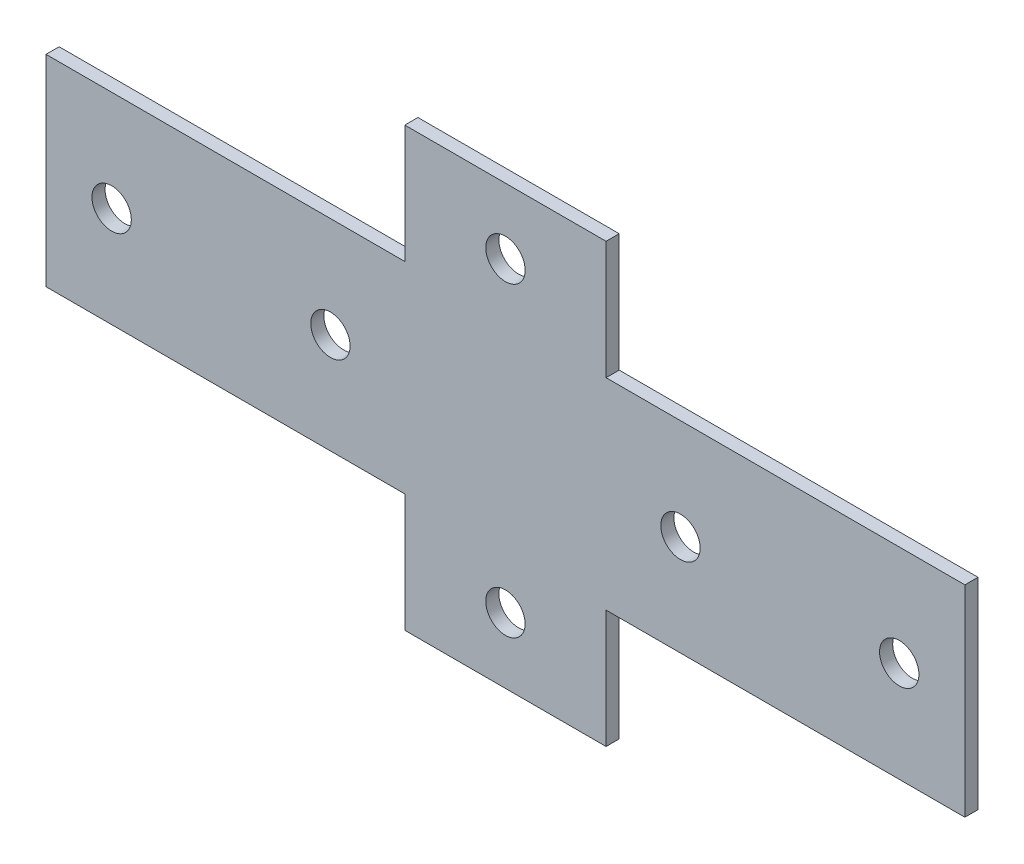
ISO-10303-21;
HEADER;
FILE_DESCRIPTION(('STEP AP214'),'2;1');
FILE_NAME('part.step','',(''),(''),'','','');
FILE_SCHEMA(('AUTOMOTIVE_DESIGN { 1 0 10303 214 1 1 1 1 }'));
ENDSEC;
DATA;
#1=APPLICATION_CONTEXT('core data for automotive mechanical design processes');
#2=APPLICATION_PROTOCOL_DEFINITION('international standard','automotive_design',2000,#1);
#3=PRODUCT_CONTEXT('',#1,'mechanical');
#4=PRODUCT('Part','Part','',(#3));
#5=PRODUCT_RELATED_PRODUCT_CATEGORY('part','',(#4));
#6=PRODUCT_DEFINITION_FORMATION('','',#4);
#7=PRODUCT_DEFINITION_CONTEXT('part definition',#1,'design');
#8=PRODUCT_DEFINITION('design','',#6,#7);
#9=PRODUCT_DEFINITION_SHAPE('','',#8);
#10=(LENGTH_UNIT() NAMED_UNIT(*) SI_UNIT(.MILLI.,.METRE.));
#11=(NAMED_UNIT(*) PLANE_ANGLE_UNIT() SI_UNIT($,.RADIAN.));
#12=(NAMED_UNIT(*) SI_UNIT($,.STERADIAN.) SOLID_ANGLE_UNIT());
#13=UNCERTAINTY_MEASURE_WITH_UNIT(LENGTH_MEASURE(1.E-05),#10,'distance_accuracy_value','');
#14=(GEOMETRIC_REPRESENTATION_CONTEXT(3) GLOBAL_UNCERTAINTY_ASSIGNED_CONTEXT((#13)) GLOBAL_UNIT_ASSIGNED_CONTEXT((#10,
#11,#12)) REPRESENTATION_CONTEXT('',''));
#15=CARTESIAN_POINT('',(0.,0.,0.));
#16=DIRECTION('',(0.,0.,1.));
#17=DIRECTION('',(1.,0.,0.));
#18=AXIS2_PLACEMENT_3D('',#15,#16,#17);
#19=CARTESIAN_POINT('',(0.,0.,3.));
#20=DIRECTION('',(0.,0.,1.));
#21=DIRECTION('',(1.,0.,0.));
#22=AXIS2_PLACEMENT_3D('',#19,#20,#21);
#23=PLANE('',#22);
#24=CARTESIAN_POINT('',(39.9999999999999,0.,3.));
#25=DIRECTION('',(0.,0.,1.));
#26=DIRECTION('',(-1.,0.,0.));
#27=AXIS2_PLACEMENT_3D('',#24,#25,#26);
#28=CIRCLE('',#27,4.5);
#29=CARTESIAN_POINT('',(35.4999999999999,0.,3.));
#30=VERTEX_POINT('',#29);
#31=EDGE_CURVE('E300',#30,#30,#28,.T.);
#32=ORIENTED_EDGE('',*,*,#31,.F.);
#33=EDGE_LOOP('',(#32));
#34=FACE_BOUND('',#33,.T.);
#35=CARTESIAN_POINT('',(-89.9999999999999,0.,3.));
#36=DIRECTION('',(0.,0.,1.));
#37=DIRECTION('',(1.,0.,0.));
#38=AXIS2_PLACEMENT_3D('',#35,#36,#37);
#39=CIRCLE('',#38,4.5);
#40=CARTESIAN_POINT('',(-85.4999999999999,0.,3.));
#41=VERTEX_POINT('',#40);
#42=EDGE_CURVE('E312',#41,#41,#39,.T.);
#43=ORIENTED_EDGE('',*,*,#42,.F.);
#44=EDGE_LOOP('',(#43));
#45=FACE_BOUND('',#44,.T.);
#46=CARTESIAN_POINT('',(0.,-35.,3.));
#47=DIRECTION('',(0.,0.,1.));
#48=DIRECTION('',(1.,0.,0.));
#49=AXIS2_PLACEMENT_3D('',#46,#47,#48);
#50=CIRCLE('',#49,4.5);
#51=CARTESIAN_POINT('',(4.5,-35.,3.));
#52=VERTEX_POINT('',#51);
#53=EDGE_CURVE('E159',#52,#52,#50,.T.);
#54=ORIENTED_EDGE('',*,*,#53,.F.);
#55=EDGE_LOOP('',(#54));
#56=FACE_BOUND('',#55,.T.);
#57=DIRECTION('',(0.,1.,0.));
#58=VECTOR('',#57,1.);
#59=CARTESIAN_POINT('',(105.,23.,3.));
#60=LINE('',#59,#58);
#61=CARTESIAN_POINT('',(105.,-23.,3.));
#62=VERTEX_POINT('',#61);
#63=CARTESIAN_POINT('',(105.,23.,3.));
#64=VERTEX_POINT('',#63);
#65=EDGE_CURVE('E178',#62,#64,#60,.T.);
#66=ORIENTED_EDGE('',*,*,#65,.T.);
#67=DIRECTION('',(-1.,0.,0.));
#68=VECTOR('',#67,1.);
#69=CARTESIAN_POINT('',(23.,23.,3.));
#70=LINE('',#69,#68);
#71=CARTESIAN_POINT('',(23.,23.,3.));
#72=VERTEX_POINT('',#71);
#73=EDGE_CURVE('E106',#64,#72,#70,.T.);
#74=ORIENTED_EDGE('',*,*,#73,.T.);
#75=DIRECTION('',(0.,1.,0.));
#76=VECTOR('',#75,1.);
#77=CARTESIAN_POINT('',(23.,23.,3.));
#78=LINE('',#77,#76);
#79=CARTESIAN_POINT('',(23.,50.,3.));
#80=VERTEX_POINT('',#79);
#81=EDGE_CURVE('E205',#72,#80,#78,.T.);
#82=ORIENTED_EDGE('',*,*,#81,.T.);
#83=DIRECTION('',(-1.,0.,0.));
#84=VECTOR('',#83,1.);
#85=CARTESIAN_POINT('',(-23.,50.,3.));
#86=LINE('',#85,#84);
#87=CARTESIAN_POINT('',(-23.,50.,3.));
#88=VERTEX_POINT('',#87);
#89=EDGE_CURVE('E224',#80,#88,#86,.T.);
#90=ORIENTED_EDGE('',*,*,#89,.T.);
#91=DIRECTION('',(0.,-1.,0.));
#92=VECTOR('',#91,1.);
#93=CARTESIAN_POINT('',(-23.,23.,3.));
#94=LINE('',#93,#92);
#95=CARTESIAN_POINT('',(-23.,23.,3.));
#96=VERTEX_POINT('',#95);
#97=EDGE_CURVE('E221',#88,#96,#94,.T.);
#98=ORIENTED_EDGE('',*,*,#97,.T.);
#99=DIRECTION('',(-1.,0.,0.));
#100=VECTOR('',#99,1.);
#101=CARTESIAN_POINT('',(-105.,23.,3.));
#102=LINE('',#101,#100);
#103=CARTESIAN_POINT('',(-105.,23.,3.));
#104=VERTEX_POINT('',#103);
#105=EDGE_CURVE('E223',#96,#104,#102,.T.);
#106=ORIENTED_EDGE('',*,*,#105,.T.);
#107=DIRECTION('',(0.,-1.,0.));
#108=VECTOR('',#107,1.);
#109=CARTESIAN_POINT('',(-105.,23.,3.));
#110=LINE('',#109,#108);
#111=CARTESIAN_POINT('',(-105.,-23.,3.));
#112=VERTEX_POINT('',#111);
#113=EDGE_CURVE('E226',#104,#112,#110,.T.);
#114=ORIENTED_EDGE('',*,*,#113,.T.);
#115=DIRECTION('',(1.,0.,0.));
#116=VECTOR('',#115,1.);
#117=CARTESIAN_POINT('',(-105.,-23.,3.));
#118=LINE('',#117,#116);
#119=CARTESIAN_POINT('',(-23.,-23.,3.));
#120=VERTEX_POINT('',#119);
#121=EDGE_CURVE('E232',#112,#120,#118,.T.);
#122=ORIENTED_EDGE('',*,*,#121,.T.);
#123=DIRECTION('',(0.,-1.,0.));
#124=VECTOR('',#123,1.);
#125=CARTESIAN_POINT('',(-23.,-50.,3.));
#126=LINE('',#125,#124);
#127=CARTESIAN_POINT('',(-23.,-50.,3.));
#128=VERTEX_POINT('',#127);
#129=EDGE_CURVE('E137',#120,#128,#126,.T.);
#130=ORIENTED_EDGE('',*,*,#129,.T.);
#131=DIRECTION('',(1.,0.,0.));
#132=VECTOR('',#131,1.);
#133=CARTESIAN_POINT('',(-23.,-50.,3.));
#134=LINE('',#133,#132);
#135=CARTESIAN_POINT('',(23.,-50.,3.));
#136=VERTEX_POINT('',#135);
#137=EDGE_CURVE('E131',#128,#136,#134,.T.);
#138=ORIENTED_EDGE('',*,*,#137,.T.);
#139=DIRECTION('',(0.,1.,0.));
#140=VECTOR('',#139,1.);
#141=CARTESIAN_POINT('',(23.,-50.,3.));
#142=LINE('',#141,#140);
#143=CARTESIAN_POINT('',(23.,-23.,3.));
#144=VERTEX_POINT('',#143);
#145=EDGE_CURVE('E135',#136,#144,#142,.T.);
#146=ORIENTED_EDGE('',*,*,#145,.T.);
#147=DIRECTION('',(1.,0.,0.));
#148=VECTOR('',#147,1.);
#149=CARTESIAN_POINT('',(23.,-23.,3.));
#150=LINE('',#149,#148);
#151=EDGE_CURVE('E51',#144,#62,#150,.T.);
#152=ORIENTED_EDGE('',*,*,#151,.T.);
#153=EDGE_LOOP('',(#66,#74,#82,#90,#98,#106,#114,#122,#130,#138,#146,#152));
#154=FACE_BOUND('',#153,.T.);
#155=CARTESIAN_POINT('',(0.,35.,3.));
#156=DIRECTION('',(0.,0.,1.));
#157=DIRECTION('',(1.,0.,0.));
#158=AXIS2_PLACEMENT_3D('',#155,#156,#157);
#159=CIRCLE('',#158,4.5);
#160=CARTESIAN_POINT('',(4.5,35.,3.));
#161=VERTEX_POINT('',#160);
#162=EDGE_CURVE('E318',#161,#161,#159,.T.);
#163=ORIENTED_EDGE('',*,*,#162,.F.);
#164=EDGE_LOOP('',(#163));
#165=FACE_BOUND('',#164,.T.);
#166=CARTESIAN_POINT('',(-39.9999999999999,0.,3.));
#167=DIRECTION('',(0.,0.,1.));
#168=DIRECTION('',(1.,0.,0.));
#169=AXIS2_PLACEMENT_3D('',#166,#167,#168);
#170=CIRCLE('',#169,4.5);
#171=CARTESIAN_POINT('',(-35.4999999999999,0.,3.));
#172=VERTEX_POINT('',#171);
#173=EDGE_CURVE('E306',#172,#172,#170,.T.);
#174=ORIENTED_EDGE('',*,*,#173,.F.);
#175=EDGE_LOOP('',(#174));
#176=FACE_BOUND('',#175,.T.);
#177=CARTESIAN_POINT('',(89.9999999999999,0.,3.));
#178=DIRECTION('',(0.,0.,1.));
#179=DIRECTION('',(-1.,0.,0.));
#180=AXIS2_PLACEMENT_3D('',#177,#178,#179);
#181=CIRCLE('',#180,4.5);
#182=CARTESIAN_POINT('',(85.4999999999999,0.,3.));
#183=VERTEX_POINT('',#182);
#184=EDGE_CURVE('E291',#183,#183,#181,.T.);
#185=ORIENTED_EDGE('',*,*,#184,.F.);
#186=EDGE_LOOP('',(#185));
#187=FACE_BOUND('',#186,.T.);
#188=ADVANCED_FACE('F34',(#34,#45,#56,#154,#165,#176,#187),#23,.T.);
#189=CARTESIAN_POINT('',(0.,0.,0.));
#190=DIRECTION('',(0.,0.,1.));
#191=DIRECTION('',(1.,0.,0.));
#192=AXIS2_PLACEMENT_3D('',#189,#190,#191);
#193=PLANE('',#192);
#194=DIRECTION('',(0.,1.,0.));
#195=VECTOR('',#194,1.);
#196=CARTESIAN_POINT('',(105.,23.,0.));
#197=LINE('',#196,#195);
#198=CARTESIAN_POINT('',(105.,-23.,0.));
#199=VERTEX_POINT('',#198);
#200=CARTESIAN_POINT('',(105.,23.,0.));
#201=VERTEX_POINT('',#200);
#202=EDGE_CURVE('E155',#199,#201,#197,.T.);
#203=ORIENTED_EDGE('',*,*,#202,.F.);
#204=DIRECTION('',(1.,0.,0.));
#205=VECTOR('',#204,1.);
#206=CARTESIAN_POINT('',(23.,-23.,0.));
#207=LINE('',#206,#205);
#208=CARTESIAN_POINT('',(23.,-23.,0.));
#209=VERTEX_POINT('',#208);
#210=EDGE_CURVE('E98',#209,#199,#207,.T.);
#211=ORIENTED_EDGE('',*,*,#210,.F.);
#212=DIRECTION('',(0.,1.,0.));
#213=VECTOR('',#212,1.);
#214=CARTESIAN_POINT('',(23.,-50.,0.));
#215=LINE('',#214,#213);
#216=CARTESIAN_POINT('',(23.,-50.,0.));
#217=VERTEX_POINT('',#216);
#218=EDGE_CURVE('E92',#217,#209,#215,.T.);
#219=ORIENTED_EDGE('',*,*,#218,.F.);
#220=DIRECTION('',(1.,0.,0.));
#221=VECTOR('',#220,1.);
#222=CARTESIAN_POINT('',(-23.,-50.,0.));
#223=LINE('',#222,#221);
#224=CARTESIAN_POINT('',(-23.,-50.,0.));
#225=VERTEX_POINT('',#224);
#226=EDGE_CURVE('E145',#225,#217,#223,.T.);
#227=ORIENTED_EDGE('',*,*,#226,.F.);
#228=DIRECTION('',(0.,-1.,0.));
#229=VECTOR('',#228,1.);
#230=CARTESIAN_POINT('',(-23.,-50.,0.));
#231=LINE('',#230,#229);
#232=CARTESIAN_POINT('',(-23.,-23.,0.));
#233=VERTEX_POINT('',#232);
#234=EDGE_CURVE('E173',#233,#225,#231,.T.);
#235=ORIENTED_EDGE('',*,*,#234,.F.);
#236=DIRECTION('',(1.,0.,0.));
#237=VECTOR('',#236,1.);
#238=CARTESIAN_POINT('',(-105.,-23.,0.));
#239=LINE('',#238,#237);
#240=CARTESIAN_POINT('',(-105.,-23.,0.));
#241=VERTEX_POINT('',#240);
#242=EDGE_CURVE('E171',#241,#233,#239,.T.);
#243=ORIENTED_EDGE('',*,*,#242,.F.);
#244=DIRECTION('',(0.,-1.,0.));
#245=VECTOR('',#244,1.);
#246=CARTESIAN_POINT('',(-105.,23.,0.));
#247=LINE('',#246,#245);
#248=CARTESIAN_POINT('',(-105.,23.,0.));
#249=VERTEX_POINT('',#248);
#250=EDGE_CURVE('E169',#249,#241,#247,.T.);
#251=ORIENTED_EDGE('',*,*,#250,.F.);
#252=DIRECTION('',(-1.,0.,0.));
#253=VECTOR('',#252,1.);
#254=CARTESIAN_POINT('',(-105.,23.,0.));
#255=LINE('',#254,#253);
#256=CARTESIAN_POINT('',(-23.,23.,0.));
#257=VERTEX_POINT('',#256);
#258=EDGE_CURVE('E167',#257,#249,#255,.T.);
#259=ORIENTED_EDGE('',*,*,#258,.F.);
#260=DIRECTION('',(0.,-1.,0.));
#261=VECTOR('',#260,1.);
#262=CARTESIAN_POINT('',(-23.,23.,0.));
#263=LINE('',#262,#261);
#264=CARTESIAN_POINT('',(-23.,50.,0.));
#265=VERTEX_POINT('',#264);
#266=EDGE_CURVE('E165',#265,#257,#263,.T.);
#267=ORIENTED_EDGE('',*,*,#266,.F.);
#268=DIRECTION('',(-1.,0.,0.));
#269=VECTOR('',#268,1.);
#270=CARTESIAN_POINT('',(-23.,50.,0.));
#271=LINE('',#270,#269);
#272=CARTESIAN_POINT('',(23.,50.,0.));
#273=VERTEX_POINT('',#272);
#274=EDGE_CURVE('E163',#273,#265,#271,.T.);
#275=ORIENTED_EDGE('',*,*,#274,.F.);
#276=DIRECTION('',(0.,1.,0.));
#277=VECTOR('',#276,1.);
#278=CARTESIAN_POINT('',(23.,23.,0.));
#279=LINE('',#278,#277);
#280=CARTESIAN_POINT('',(23.,23.,0.));
#281=VERTEX_POINT('',#280);
#282=EDGE_CURVE('E161',#281,#273,#279,.T.);
#283=ORIENTED_EDGE('',*,*,#282,.F.);
#284=DIRECTION('',(-1.,0.,0.));
#285=VECTOR('',#284,1.);
#286=CARTESIAN_POINT('',(23.,23.,0.));
#287=LINE('',#286,#285);
#288=EDGE_CURVE('E158',#201,#281,#287,.T.);
#289=ORIENTED_EDGE('',*,*,#288,.F.);
#290=EDGE_LOOP('',(#203,#211,#219,#227,#235,#243,#251,#259,#267,#275,#283,#289));
#291=FACE_BOUND('',#290,.T.);
#292=CARTESIAN_POINT('',(0.,-35.,0.));
#293=DIRECTION('',(0.,0.,1.));
#294=DIRECTION('',(1.,0.,0.));
#295=AXIS2_PLACEMENT_3D('',#292,#293,#294);
#296=CIRCLE('',#295,4.5);
#297=CARTESIAN_POINT('',(4.5,-35.,0.));
#298=VERTEX_POINT('',#297);
#299=EDGE_CURVE('E321',#298,#298,#296,.T.);
#300=ORIENTED_EDGE('',*,*,#299,.T.);
#301=EDGE_LOOP('',(#300));
#302=FACE_BOUND('',#301,.T.);
#303=CARTESIAN_POINT('',(0.,35.,0.));
#304=DIRECTION('',(0.,0.,1.));
#305=DIRECTION('',(1.,0.,0.));
#306=AXIS2_PLACEMENT_3D('',#303,#304,#305);
#307=CIRCLE('',#306,4.5);
#308=CARTESIAN_POINT('',(4.5,35.,0.));
#309=VERTEX_POINT('',#308);
#310=EDGE_CURVE('E315',#309,#309,#307,.T.);
#311=ORIENTED_EDGE('',*,*,#310,.T.);
#312=EDGE_LOOP('',(#311));
#313=FACE_BOUND('',#312,.T.);
#314=CARTESIAN_POINT('',(-89.9999999999999,0.,0.));
#315=DIRECTION('',(0.,0.,1.));
#316=DIRECTION('',(1.,0.,0.));
#317=AXIS2_PLACEMENT_3D('',#314,#315,#316);
#318=CIRCLE('',#317,4.5);
#319=CARTESIAN_POINT('',(-85.4999999999999,0.,0.));
#320=VERTEX_POINT('',#319);
#321=EDGE_CURVE('E309',#320,#320,#318,.T.);
#322=ORIENTED_EDGE('',*,*,#321,.T.);
#323=EDGE_LOOP('',(#322));
#324=FACE_BOUND('',#323,.T.);
#325=CARTESIAN_POINT('',(-39.9999999999999,0.,0.));
#326=DIRECTION('',(0.,0.,1.));
#327=DIRECTION('',(1.,0.,0.));
#328=AXIS2_PLACEMENT_3D('',#325,#326,#327);
#329=CIRCLE('',#328,4.5);
#330=CARTESIAN_POINT('',(-35.4999999999999,0.,0.));
#331=VERTEX_POINT('',#330);
#332=EDGE_CURVE('E303',#331,#331,#329,.T.);
#333=ORIENTED_EDGE('',*,*,#332,.T.);
#334=EDGE_LOOP('',(#333));
#335=FACE_BOUND('',#334,.T.);
#336=CARTESIAN_POINT('',(39.9999999999999,0.,0.));
#337=DIRECTION('',(0.,0.,1.));
#338=DIRECTION('',(-1.,0.,0.));
#339=AXIS2_PLACEMENT_3D('',#336,#337,#338);
#340=CIRCLE('',#339,4.5);
#341=CARTESIAN_POINT('',(35.4999999999999,0.,0.));
#342=VERTEX_POINT('',#341);
#343=EDGE_CURVE('E297',#342,#342,#340,.T.);
#344=ORIENTED_EDGE('',*,*,#343,.T.);
#345=EDGE_LOOP('',(#344));
#346=FACE_BOUND('',#345,.T.);
#347=CARTESIAN_POINT('',(89.9999999999999,0.,0.));
#348=DIRECTION('',(0.,0.,1.));
#349=DIRECTION('',(-1.,0.,0.));
#350=AXIS2_PLACEMENT_3D('',#347,#348,#349);
#351=CIRCLE('',#350,4.5);
#352=CARTESIAN_POINT('',(85.4999999999999,0.,0.));
#353=VERTEX_POINT('',#352);
#354=EDGE_CURVE('E294',#353,#353,#351,.T.);
#355=ORIENTED_EDGE('',*,*,#354,.T.);
#356=EDGE_LOOP('',(#355));
#357=FACE_BOUND('',#356,.T.);
#358=ADVANCED_FACE('F209',(#291,#302,#313,#324,#335,#346,#357),#193,.F.);
#359=CARTESIAN_POINT('',(105.,23.,3.));
#360=DIRECTION('',(-1.,0.,0.));
#361=DIRECTION('',(0.,0.,1.));
#362=AXIS2_PLACEMENT_3D('',#359,#360,#361);
#363=PLANE('',#362);
#364=ORIENTED_EDGE('',*,*,#202,.T.);
#365=DIRECTION('',(0.,0.,-1.));
#366=VECTOR('',#365,1.);
#367=CARTESIAN_POINT('',(105.,23.,3.));
#368=LINE('',#367,#366);
#369=EDGE_CURVE('E11',#64,#201,#368,.T.);
#370=ORIENTED_EDGE('',*,*,#369,.F.);
#371=ORIENTED_EDGE('',*,*,#65,.F.);
#372=DIRECTION('',(0.,0.,-1.));
#373=VECTOR('',#372,1.);
#374=CARTESIAN_POINT('',(105.,-23.,3.));
#375=LINE('',#374,#373);
#376=EDGE_CURVE('E151',#62,#199,#375,.T.);
#377=ORIENTED_EDGE('',*,*,#376,.T.);
#378=EDGE_LOOP('',(#364,#370,#371,#377));
#379=FACE_BOUND('',#378,.T.);
#380=ADVANCED_FACE('F36',(#379),#363,.F.);
#381=CARTESIAN_POINT('',(23.,23.,3.));
#382=DIRECTION('',(0.,-1.,0.));
#383=DIRECTION('',(1.,0.,0.));
#384=AXIS2_PLACEMENT_3D('',#381,#382,#383);
#385=PLANE('',#384);
#386=ORIENTED_EDGE('',*,*,#288,.T.);
#387=DIRECTION('',(0.,0.,-1.));
#388=VECTOR('',#387,1.);
#389=CARTESIAN_POINT('',(23.,23.,3.));
#390=LINE('',#389,#388);
#391=EDGE_CURVE('E43',#72,#281,#390,.T.);
#392=ORIENTED_EDGE('',*,*,#391,.F.);
#393=ORIENTED_EDGE('',*,*,#73,.F.);
#394=ORIENTED_EDGE('',*,*,#369,.T.);
#395=EDGE_LOOP('',(#386,#392,#393,#394));
#396=FACE_BOUND('',#395,.T.);
#397=ADVANCED_FACE('F449',(#396),#385,.F.);
#398=CARTESIAN_POINT('',(23.,23.,3.));
#399=DIRECTION('',(-1.,0.,0.));
#400=DIRECTION('',(0.,0.,1.));
#401=AXIS2_PLACEMENT_3D('',#398,#399,#400);
#402=PLANE('',#401);
#403=ORIENTED_EDGE('',*,*,#282,.T.);
#404=DIRECTION('',(0.,0.,-1.));
#405=VECTOR('',#404,1.);
#406=CARTESIAN_POINT('',(23.,50.,3.));
#407=LINE('',#406,#405);
#408=EDGE_CURVE('E197',#80,#273,#407,.T.);
#409=ORIENTED_EDGE('',*,*,#408,.F.);
#410=ORIENTED_EDGE('',*,*,#81,.F.);
#411=ORIENTED_EDGE('',*,*,#391,.T.);
#412=EDGE_LOOP('',(#403,#409,#410,#411));
#413=FACE_BOUND('',#412,.T.);
#414=ADVANCED_FACE('F203',(#413),#402,.F.);
#415=CARTESIAN_POINT('',(-23.,50.,3.));
#416=DIRECTION('',(0.,-1.,0.));
#417=DIRECTION('',(0.,0.,-1.));
#418=AXIS2_PLACEMENT_3D('',#415,#416,#417);
#419=PLANE('',#418);
#420=ORIENTED_EDGE('',*,*,#274,.T.);
#421=DIRECTION('',(0.,0.,-1.));
#422=VECTOR('',#421,1.);
#423=CARTESIAN_POINT('',(-23.,50.,3.));
#424=LINE('',#423,#422);
#425=EDGE_CURVE('E194',#88,#265,#424,.T.);
#426=ORIENTED_EDGE('',*,*,#425,.F.);
#427=ORIENTED_EDGE('',*,*,#89,.F.);
#428=ORIENTED_EDGE('',*,*,#408,.T.);
#429=EDGE_LOOP('',(#420,#426,#427,#428));
#430=FACE_BOUND('',#429,.T.);
#431=ADVANCED_FACE('F215',(#430),#419,.F.);
#432=CARTESIAN_POINT('',(-23.,23.,3.));
#433=DIRECTION('',(1.,0.,0.));
#434=DIRECTION('',(0.,0.,-1.));
#435=AXIS2_PLACEMENT_3D('',#432,#433,#434);
#436=PLANE('',#435);
#437=ORIENTED_EDGE('',*,*,#266,.T.);
#438=DIRECTION('',(0.,0.,-1.));
#439=VECTOR('',#438,1.);
#440=CARTESIAN_POINT('',(-23.,23.,3.));
#441=LINE('',#440,#439);
#442=EDGE_CURVE('E191',#96,#257,#441,.T.);
#443=ORIENTED_EDGE('',*,*,#442,.F.);
#444=ORIENTED_EDGE('',*,*,#97,.F.);
#445=ORIENTED_EDGE('',*,*,#425,.T.);
#446=EDGE_LOOP('',(#437,#443,#444,#445));
#447=FACE_BOUND('',#446,.T.);
#448=ADVANCED_FACE('F219',(#447),#436,.F.);
#449=CARTESIAN_POINT('',(-105.,23.,3.));
#450=DIRECTION('',(0.,-1.,0.));
#451=DIRECTION('',(1.,0.,0.));
#452=AXIS2_PLACEMENT_3D('',#449,#450,#451);
#453=PLANE('',#452);
#454=ORIENTED_EDGE('',*,*,#258,.T.);
#455=DIRECTION('',(0.,0.,-1.));
#456=VECTOR('',#455,1.);
#457=CARTESIAN_POINT('',(-105.,23.,3.));
#458=LINE('',#457,#456);
#459=EDGE_CURVE('E188',#104,#249,#458,.T.);
#460=ORIENTED_EDGE('',*,*,#459,.F.);
#461=ORIENTED_EDGE('',*,*,#105,.F.);
#462=ORIENTED_EDGE('',*,*,#442,.T.);
#463=EDGE_LOOP('',(#454,#460,#461,#462));
#464=FACE_BOUND('',#463,.T.);
#465=ADVANCED_FACE('F414',(#464),#453,.F.);
#466=CARTESIAN_POINT('',(-105.,23.,3.));
#467=DIRECTION('',(1.,0.,0.));
#468=DIRECTION('',(0.,0.,-1.));
#469=AXIS2_PLACEMENT_3D('',#466,#467,#468);
#470=PLANE('',#469);
#471=ORIENTED_EDGE('',*,*,#250,.T.);
#472=DIRECTION('',(0.,0.,-1.));
#473=VECTOR('',#472,1.);
#474=CARTESIAN_POINT('',(-105.,-23.,3.));
#475=LINE('',#474,#473);
#476=EDGE_CURVE('E185',#112,#241,#475,.T.);
#477=ORIENTED_EDGE('',*,*,#476,.F.);
#478=ORIENTED_EDGE('',*,*,#113,.F.);
#479=ORIENTED_EDGE('',*,*,#459,.T.);
#480=EDGE_LOOP('',(#471,#477,#478,#479));
#481=FACE_BOUND('',#480,.T.);
#482=ADVANCED_FACE('F405',(#481),#470,.F.);
#483=CARTESIAN_POINT('',(-105.,-23.,3.));
#484=DIRECTION('',(0.,1.,0.));
#485=DIRECTION('',(0.,0.,1.));
#486=AXIS2_PLACEMENT_3D('',#483,#484,#485);
#487=PLANE('',#486);
#488=ORIENTED_EDGE('',*,*,#242,.T.);
#489=DIRECTION('',(0.,0.,-1.));
#490=VECTOR('',#489,1.);
#491=CARTESIAN_POINT('',(-23.,-23.,3.));
#492=LINE('',#491,#490);
#493=EDGE_CURVE('E182',#120,#233,#492,.T.);
#494=ORIENTED_EDGE('',*,*,#493,.F.);
#495=ORIENTED_EDGE('',*,*,#121,.F.);
#496=ORIENTED_EDGE('',*,*,#476,.T.);
#497=EDGE_LOOP('',(#488,#494,#495,#496));
#498=FACE_BOUND('',#497,.T.);
#499=ADVANCED_FACE('F238',(#498),#487,.F.);
#500=CARTESIAN_POINT('',(-23.,-50.,3.));
#501=DIRECTION('',(1.,0.,0.));
#502=DIRECTION('',(0.,1.,0.));
#503=AXIS2_PLACEMENT_3D('',#500,#501,#502);
#504=PLANE('',#503);
#505=ORIENTED_EDGE('',*,*,#234,.T.);
#506=DIRECTION('',(0.,0.,-1.));
#507=VECTOR('',#506,1.);
#508=CARTESIAN_POINT('',(-23.,-50.,3.));
#509=LINE('',#508,#507);
#510=EDGE_CURVE('E146',#128,#225,#509,.T.);
#511=ORIENTED_EDGE('',*,*,#510,.F.);
#512=ORIENTED_EDGE('',*,*,#129,.F.);
#513=ORIENTED_EDGE('',*,*,#493,.T.);
#514=EDGE_LOOP('',(#505,#511,#512,#513));
#515=FACE_BOUND('',#514,.T.);
#516=ADVANCED_FACE('F242',(#515),#504,.F.);
#517=CARTESIAN_POINT('',(-23.,-50.,3.));
#518=DIRECTION('',(0.,1.,0.));
#519=DIRECTION('',(0.,0.,1.));
#520=AXIS2_PLACEMENT_3D('',#517,#518,#519);
#521=PLANE('',#520);
#522=ORIENTED_EDGE('',*,*,#226,.T.);
#523=DIRECTION('',(0.,0.,-1.));
#524=VECTOR('',#523,1.);
#525=CARTESIAN_POINT('',(23.,-50.,3.));
#526=LINE('',#525,#524);
#527=EDGE_CURVE('E142',#136,#217,#526,.T.);
#528=ORIENTED_EDGE('',*,*,#527,.F.);
#529=ORIENTED_EDGE('',*,*,#137,.F.);
#530=ORIENTED_EDGE('',*,*,#510,.T.);
#531=EDGE_LOOP('',(#522,#528,#529,#530));
#532=FACE_BOUND('',#531,.T.);
#533=ADVANCED_FACE('F143',(#532),#521,.F.);
#534=CARTESIAN_POINT('',(23.,-50.,3.));
#535=DIRECTION('',(-1.,0.,0.));
#536=DIRECTION('',(0.,-1.,0.));
#537=AXIS2_PLACEMENT_3D('',#534,#535,#536);
#538=PLANE('',#537);
#539=ORIENTED_EDGE('',*,*,#218,.T.);
#540=DIRECTION('',(0.,0.,-1.));
#541=VECTOR('',#540,1.);
#542=CARTESIAN_POINT('',(23.,-23.,3.));
#543=LINE('',#542,#541);
#544=EDGE_CURVE('E147',#144,#209,#543,.T.);
#545=ORIENTED_EDGE('',*,*,#544,.F.);
#546=ORIENTED_EDGE('',*,*,#145,.F.);
#547=ORIENTED_EDGE('',*,*,#527,.T.);
#548=EDGE_LOOP('',(#539,#545,#546,#547));
#549=FACE_BOUND('',#548,.T.);
#550=ADVANCED_FACE('F149',(#549),#538,.F.);
#551=CARTESIAN_POINT('',(23.,-23.,3.));
#552=DIRECTION('',(0.,1.,0.));
#553=DIRECTION('',(-1.,0.,0.));
#554=AXIS2_PLACEMENT_3D('',#551,#552,#553);
#555=PLANE('',#554);
#556=ORIENTED_EDGE('',*,*,#210,.T.);
#557=ORIENTED_EDGE('',*,*,#376,.F.);
#558=ORIENTED_EDGE('',*,*,#151,.F.);
#559=ORIENTED_EDGE('',*,*,#544,.T.);
#560=EDGE_LOOP('',(#556,#557,#558,#559));
#561=FACE_BOUND('',#560,.T.);
#562=ADVANCED_FACE('F246',(#561),#555,.F.);
#563=CARTESIAN_POINT('',(0.,-35.,3.));
#564=DIRECTION('',(0.,0.,-1.));
#565=DIRECTION('',(-1.,0.,0.));
#566=AXIS2_PLACEMENT_3D('',#563,#564,#565);
#567=CYLINDRICAL_SURFACE('',#566,4.5);
#568=ORIENTED_EDGE('',*,*,#53,.T.);
#569=EDGE_LOOP('',(#568));
#570=FACE_BOUND('',#569,.T.);
#571=ORIENTED_EDGE('',*,*,#299,.F.);
#572=EDGE_LOOP('',(#571));
#573=FACE_BOUND('',#572,.T.);
#574=ADVANCED_FACE('F248',(#570,#573),#567,.F.);
#575=CARTESIAN_POINT('',(0.,35.,3.));
#576=DIRECTION('',(0.,0.,-1.));
#577=DIRECTION('',(-1.,0.,0.));
#578=AXIS2_PLACEMENT_3D('',#575,#576,#577);
#579=CYLINDRICAL_SURFACE('',#578,4.5);
#580=ORIENTED_EDGE('',*,*,#162,.T.);
#581=EDGE_LOOP('',(#580));
#582=FACE_BOUND('',#581,.T.);
#583=ORIENTED_EDGE('',*,*,#310,.F.);
#584=EDGE_LOOP('',(#583));
#585=FACE_BOUND('',#584,.T.);
#586=ADVANCED_FACE('F254',(#582,#585),#579,.F.);
#587=CARTESIAN_POINT('',(-89.9999999999999,0.,3.));
#588=DIRECTION('',(0.,0.,-1.));
#589=DIRECTION('',(-1.,0.,0.));
#590=AXIS2_PLACEMENT_3D('',#587,#588,#589);
#591=CYLINDRICAL_SURFACE('',#590,4.5);
#592=ORIENTED_EDGE('',*,*,#42,.T.);
#593=EDGE_LOOP('',(#592));
#594=FACE_BOUND('',#593,.T.);
#595=ORIENTED_EDGE('',*,*,#321,.F.);
#596=EDGE_LOOP('',(#595));
#597=FACE_BOUND('',#596,.T.);
#598=ADVANCED_FACE('F270',(#594,#597),#591,.F.);
#599=CARTESIAN_POINT('',(-39.9999999999999,0.,3.));
#600=DIRECTION('',(0.,0.,-1.));
#601=DIRECTION('',(-1.,0.,0.));
#602=AXIS2_PLACEMENT_3D('',#599,#600,#601);
#603=CYLINDRICAL_SURFACE('',#602,4.5);
#604=ORIENTED_EDGE('',*,*,#173,.T.);
#605=EDGE_LOOP('',(#604));
#606=FACE_BOUND('',#605,.T.);
#607=ORIENTED_EDGE('',*,*,#332,.F.);
#608=EDGE_LOOP('',(#607));
#609=FACE_BOUND('',#608,.T.);
#610=ADVANCED_FACE('F274',(#606,#609),#603,.F.);
#611=CARTESIAN_POINT('',(39.9999999999999,0.,3.));
#612=DIRECTION('',(0.,0.,-1.));
#613=DIRECTION('',(-1.,0.,0.));
#614=AXIS2_PLACEMENT_3D('',#611,#612,#613);
#615=CYLINDRICAL_SURFACE('',#614,4.5);
#616=ORIENTED_EDGE('',*,*,#31,.T.);
#617=EDGE_LOOP('',(#616));
#618=FACE_BOUND('',#617,.T.);
#619=ORIENTED_EDGE('',*,*,#343,.F.);
#620=EDGE_LOOP('',(#619));
#621=FACE_BOUND('',#620,.T.);
#622=ADVANCED_FACE('F278',(#618,#621),#615,.F.);
#623=CARTESIAN_POINT('',(89.9999999999999,0.,3.));
#624=DIRECTION('',(0.,0.,-1.));
#625=DIRECTION('',(-1.,0.,0.));
#626=AXIS2_PLACEMENT_3D('',#623,#624,#625);
#627=CYLINDRICAL_SURFACE('',#626,4.5);
#628=ORIENTED_EDGE('',*,*,#184,.T.);
#629=EDGE_LOOP('',(#628));
#630=FACE_BOUND('',#629,.T.);
#631=ORIENTED_EDGE('',*,*,#354,.F.);
#632=EDGE_LOOP('',(#631));
#633=FACE_BOUND('',#632,.T.);
#634=ADVANCED_FACE('F282',(#630,#633),#627,.F.);
#635=CLOSED_SHELL('',(#188,#358,#380,#397,#414,#431,#448,#465,#482,#499,#516,#533,#550,#562,
#574,#586,#598,#610,#622,#634));
#636=MANIFOLD_SOLID_BREP('B2',#635);
#637=ADVANCED_BREP_SHAPE_REPRESENTATION('',(#18,#636),#14);
#638=SHAPE_DEFINITION_REPRESENTATION(#9,#637);
ENDSEC;
END-ISO-10303-21;
